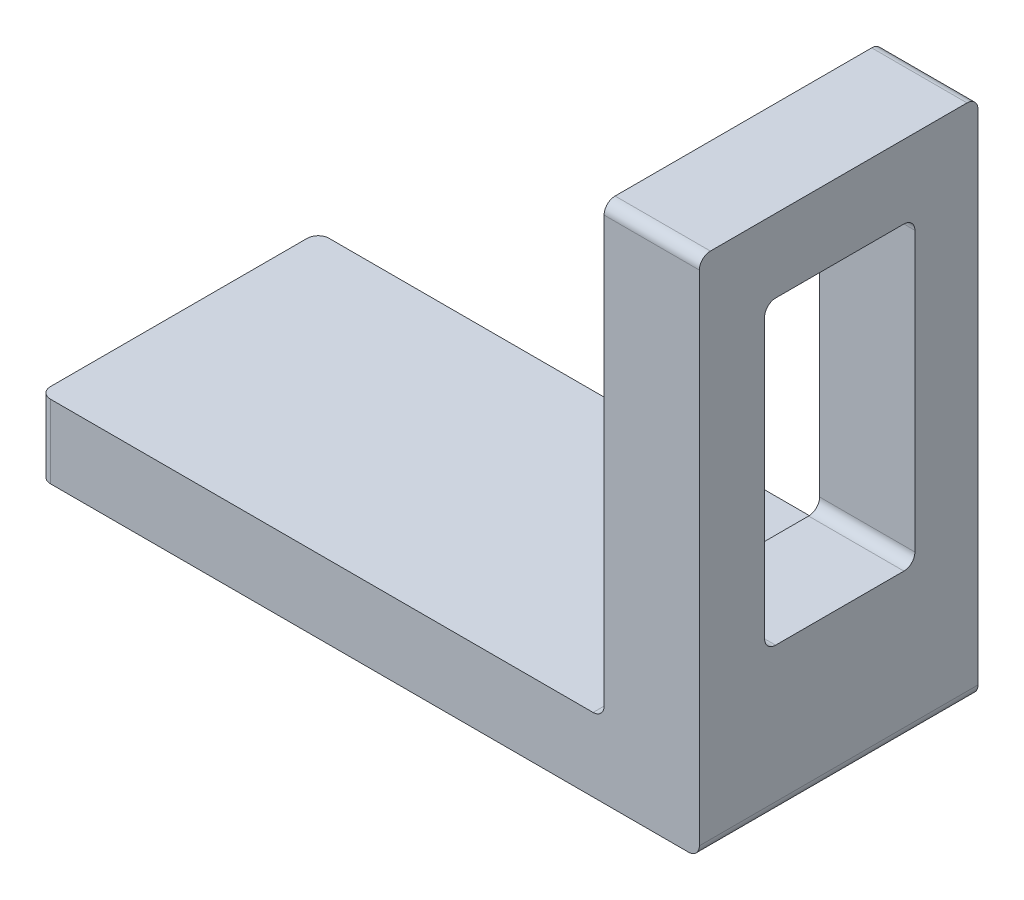
ISO-10303-21;
HEADER;
FILE_DESCRIPTION(('STEP AP214'),'2;1');
FILE_NAME('part.step','',(''),(''),'','','');
FILE_SCHEMA(('AUTOMOTIVE_DESIGN { 1 0 10303 214 1 1 1 1 }'));
ENDSEC;
DATA;
#1=APPLICATION_CONTEXT('core data for automotive mechanical design processes');
#2=APPLICATION_PROTOCOL_DEFINITION('international standard','automotive_design',2000,#1);
#3=PRODUCT_CONTEXT('',#1,'mechanical');
#4=PRODUCT('Part','Part','',(#3));
#5=PRODUCT_RELATED_PRODUCT_CATEGORY('part','',(#4));
#6=PRODUCT_DEFINITION_FORMATION('','',#4);
#7=PRODUCT_DEFINITION_CONTEXT('part definition',#1,'design');
#8=PRODUCT_DEFINITION('design','',#6,#7);
#9=PRODUCT_DEFINITION_SHAPE('','',#8);
#10=(LENGTH_UNIT() NAMED_UNIT(*) SI_UNIT(.MILLI.,.METRE.));
#11=(NAMED_UNIT(*) PLANE_ANGLE_UNIT() SI_UNIT($,.RADIAN.));
#12=(NAMED_UNIT(*) SI_UNIT($,.STERADIAN.) SOLID_ANGLE_UNIT());
#13=UNCERTAINTY_MEASURE_WITH_UNIT(LENGTH_MEASURE(1.E-05),#10,'distance_accuracy_value','');
#14=(GEOMETRIC_REPRESENTATION_CONTEXT(3) GLOBAL_UNCERTAINTY_ASSIGNED_CONTEXT((#13)) GLOBAL_UNIT_ASSIGNED_CONTEXT((#10,
#11,#12)) REPRESENTATION_CONTEXT('',''));
#15=CARTESIAN_POINT('',(0.,0.,0.));
#16=DIRECTION('',(0.,0.,1.));
#17=DIRECTION('',(1.,0.,0.));
#18=AXIS2_PLACEMENT_3D('',#15,#16,#17);
#19=CARTESIAN_POINT('',(0.,10.,38.));
#20=DIRECTION('',(1.,0.,0.));
#21=DIRECTION('',(0.,1.,0.));
#22=AXIS2_PLACEMENT_3D('',#19,#20,#21);
#23=PLANE('',#22);
#24=DIRECTION('',(0.,0.,-1.));
#25=VECTOR('',#24,1.);
#26=CARTESIAN_POINT('',(0.,10.,38.));
#27=LINE('',#26,#25);
#28=CARTESIAN_POINT('',(0.,10.,36.5));
#29=VERTEX_POINT('',#28);
#30=CARTESIAN_POINT('',(0.,10.,1.5));
#31=VERTEX_POINT('',#30);
#32=EDGE_CURVE('E361',#29,#31,#27,.T.);
#33=ORIENTED_EDGE('',*,*,#32,.T.);
#34=DIRECTION('',(0.,-1.,0.));
#35=VECTOR('',#34,1.);
#36=CARTESIAN_POINT('',(0.,10.,1.5));
#37=LINE('',#36,#35);
#38=CARTESIAN_POINT('',(0.,0.,1.5));
#39=VERTEX_POINT('',#38);
#40=EDGE_CURVE('E261',#31,#39,#37,.T.);
#41=ORIENTED_EDGE('',*,*,#40,.T.);
#42=DIRECTION('',(0.,0.,-1.));
#43=VECTOR('',#42,1.);
#44=CARTESIAN_POINT('',(0.,0.,38.));
#45=LINE('',#44,#43);
#46=CARTESIAN_POINT('',(0.,0.,36.5));
#47=VERTEX_POINT('',#46);
#48=EDGE_CURVE('E209',#47,#39,#45,.T.);
#49=ORIENTED_EDGE('',*,*,#48,.F.);
#50=DIRECTION('',(0.,-1.,0.));
#51=VECTOR('',#50,1.);
#52=CARTESIAN_POINT('',(0.,10.,36.5));
#53=LINE('',#52,#51);
#54=EDGE_CURVE('E258',#47,#29,#53,.F.);
#55=ORIENTED_EDGE('',*,*,#54,.T.);
#56=EDGE_LOOP('',(#33,#41,#49,#55));
#57=FACE_BOUND('',#56,.T.);
#58=ADVANCED_FACE('F39',(#57),#23,.F.);
#59=CARTESIAN_POINT('',(0.,0.,38.));
#60=DIRECTION('',(0.,1.,0.));
#61=DIRECTION('',(0.,0.,1.));
#62=AXIS2_PLACEMENT_3D('',#59,#60,#61);
#63=PLANE('',#62);
#64=CARTESIAN_POINT('',(23.6,0.,19.));
#65=DIRECTION('',(0.,-1.,0.));
#66=DIRECTION('',(0.,0.,-1.));
#67=AXIS2_PLACEMENT_3D('',#64,#65,#66);
#68=CIRCLE('',#67,1.4);
#69=CARTESIAN_POINT('',(23.6,0.,17.6));
#70=VERTEX_POINT('',#69);
#71=EDGE_CURVE('E441',#70,#70,#68,.T.);
#72=ORIENTED_EDGE('',*,*,#71,.F.);
#73=EDGE_LOOP('',(#72));
#74=FACE_BOUND('',#73,.T.);
#75=CARTESIAN_POINT('',(34.1,0.,8.5));
#76=DIRECTION('',(0.,-1.,0.));
#77=DIRECTION('',(0.,0.,-1.));
#78=AXIS2_PLACEMENT_3D('',#75,#76,#77);
#79=CIRCLE('',#78,1.4);
#80=CARTESIAN_POINT('',(34.1,0.,7.1));
#81=VERTEX_POINT('',#80);
#82=EDGE_CURVE('E437',#81,#81,#79,.T.);
#83=ORIENTED_EDGE('',*,*,#82,.F.);
#84=EDGE_LOOP('',(#83));
#85=FACE_BOUND('',#84,.T.);
#86=CARTESIAN_POINT('',(44.6,0.,19.));
#87=DIRECTION('',(0.,-1.,0.));
#88=DIRECTION('',(0.,0.,-1.));
#89=AXIS2_PLACEMENT_3D('',#86,#87,#88);
#90=CIRCLE('',#89,1.4);
#91=CARTESIAN_POINT('',(44.6,0.,17.6));
#92=VERTEX_POINT('',#91);
#93=EDGE_CURVE('E429',#92,#92,#90,.T.);
#94=ORIENTED_EDGE('',*,*,#93,.F.);
#95=EDGE_LOOP('',(#94));
#96=FACE_BOUND('',#95,.T.);
#97=CARTESIAN_POINT('',(34.1,0.,29.5));
#98=DIRECTION('',(0.,-1.,0.));
#99=DIRECTION('',(0.,0.,-1.));
#100=AXIS2_PLACEMENT_3D('',#97,#98,#99);
#101=CIRCLE('',#100,1.4);
#102=CARTESIAN_POINT('',(34.1,0.,28.1));
#103=VERTEX_POINT('',#102);
#104=EDGE_CURVE('E420',#103,#103,#101,.T.);
#105=ORIENTED_EDGE('',*,*,#104,.F.);
#106=EDGE_LOOP('',(#105));
#107=FACE_BOUND('',#106,.T.);
#108=ORIENTED_EDGE('',*,*,#48,.T.);
#109=CARTESIAN_POINT('',(1.5,0.,1.5));
#110=DIRECTION('',(0.,1.,0.));
#111=DIRECTION('',(0.,0.,1.));
#112=AXIS2_PLACEMENT_3D('',#109,#110,#111);
#113=CIRCLE('',#112,1.5);
#114=CARTESIAN_POINT('',(1.5,0.,0.));
#115=VERTEX_POINT('',#114);
#116=EDGE_CURVE('E271',#39,#115,#113,.F.);
#117=ORIENTED_EDGE('',*,*,#116,.T.);
#118=DIRECTION('',(1.,0.,0.));
#119=VECTOR('',#118,1.);
#120=CARTESIAN_POINT('',(0.,0.,0.));
#121=LINE('',#120,#119);
#122=CARTESIAN_POINT('',(88.5,0.,0.));
#123=VERTEX_POINT('',#122);
#124=EDGE_CURVE('E372',#115,#123,#121,.T.);
#125=ORIENTED_EDGE('',*,*,#124,.T.);
#126=DIRECTION('',(0.,0.,-1.));
#127=VECTOR('',#126,1.);
#128=CARTESIAN_POINT('',(88.5,0.,38.));
#129=LINE('',#128,#127);
#130=CARTESIAN_POINT('',(88.5,0.,38.));
#131=VERTEX_POINT('',#130);
#132=EDGE_CURVE('E265',#123,#131,#129,.F.);
#133=ORIENTED_EDGE('',*,*,#132,.T.);
#134=DIRECTION('',(1.,0.,0.));
#135=VECTOR('',#134,1.);
#136=CARTESIAN_POINT('',(0.,0.,38.));
#137=LINE('',#136,#135);
#138=CARTESIAN_POINT('',(1.5,0.,38.));
#139=VERTEX_POINT('',#138);
#140=EDGE_CURVE('E380',#139,#131,#137,.T.);
#141=ORIENTED_EDGE('',*,*,#140,.F.);
#142=CARTESIAN_POINT('',(1.5,0.,36.5));
#143=DIRECTION('',(0.,1.,0.));
#144=DIRECTION('',(0.,0.,1.));
#145=AXIS2_PLACEMENT_3D('',#142,#143,#144);
#146=CIRCLE('',#145,1.5);
#147=EDGE_CURVE('E268',#139,#47,#146,.F.);
#148=ORIENTED_EDGE('',*,*,#147,.T.);
#149=EDGE_LOOP('',(#108,#117,#125,#133,#141,#148));
#150=FACE_BOUND('',#149,.T.);
#151=ADVANCED_FACE('F400',(#74,#85,#96,#107,#150),#63,.F.);
#152=CARTESIAN_POINT('',(90.,0.,38.));
#153=DIRECTION('',(-1.,0.,0.));
#154=DIRECTION('',(0.,0.,1.));
#155=AXIS2_PLACEMENT_3D('',#152,#153,#154);
#156=PLANE('',#155);
#157=DIRECTION('',(0.,0.,1.));
#158=VECTOR('',#157,1.);
#159=CARTESIAN_POINT('',(90.,61.,8.60479197064023));
#160=LINE('',#159,#158);
#161=CARTESIAN_POINT('',(90.,61.,10.1047919706402));
#162=VERTEX_POINT('',#161);
#163=CARTESIAN_POINT('',(90.,61.,27.6047919706402));
#164=VERTEX_POINT('',#163);
#165=EDGE_CURVE('E421',#162,#164,#160,.T.);
#166=ORIENTED_EDGE('',*,*,#165,.F.);
#167=CARTESIAN_POINT('',(90.,59.5,10.1047919706402));
#168=DIRECTION('',(-1.,0.,0.));
#169=DIRECTION('',(0.,0.,1.));
#170=AXIS2_PLACEMENT_3D('',#167,#168,#169);
#171=CIRCLE('',#170,1.5);
#172=CARTESIAN_POINT('',(90.,59.5,8.60479197064023));
#173=VERTEX_POINT('',#172);
#174=EDGE_CURVE('E191',#162,#173,#171,.T.);
#175=ORIENTED_EDGE('',*,*,#174,.T.);
#176=DIRECTION('',(0.,-1.,0.));
#177=VECTOR('',#176,1.);
#178=CARTESIAN_POINT('',(90.,61.,8.60479197064023));
#179=LINE('',#178,#177);
#180=CARTESIAN_POINT('',(90.,21.5,8.60479197064024));
#181=VERTEX_POINT('',#180);
#182=EDGE_CURVE('E203',#173,#181,#179,.T.);
#183=ORIENTED_EDGE('',*,*,#182,.T.);
#184=CARTESIAN_POINT('',(90.,21.5,10.1047919706402));
#185=DIRECTION('',(-1.,0.,0.));
#186=DIRECTION('',(0.,0.,1.));
#187=AXIS2_PLACEMENT_3D('',#184,#185,#186);
#188=CIRCLE('',#187,1.5);
#189=CARTESIAN_POINT('',(90.,20.,10.1047919706402));
#190=VERTEX_POINT('',#189);
#191=EDGE_CURVE('E255',#181,#190,#188,.T.);
#192=ORIENTED_EDGE('',*,*,#191,.T.);
#193=DIRECTION('',(0.,0.,1.));
#194=VECTOR('',#193,1.);
#195=CARTESIAN_POINT('',(90.,20.,8.60479197064024));
#196=LINE('',#195,#194);
#197=CARTESIAN_POINT('',(90.,20.,27.6047919706402));
#198=VERTEX_POINT('',#197);
#199=EDGE_CURVE('E464',#190,#198,#196,.T.);
#200=ORIENTED_EDGE('',*,*,#199,.T.);
#201=CARTESIAN_POINT('',(90.,21.5,27.6047919706402));
#202=DIRECTION('',(-1.,0.,0.));
#203=DIRECTION('',(0.,0.,1.));
#204=AXIS2_PLACEMENT_3D('',#201,#202,#203);
#205=CIRCLE('',#204,1.5);
#206=CARTESIAN_POINT('',(90.,21.5,29.1047919706402));
#207=VERTEX_POINT('',#206);
#208=EDGE_CURVE('E249',#198,#207,#205,.T.);
#209=ORIENTED_EDGE('',*,*,#208,.T.);
#210=DIRECTION('',(0.,-1.,0.));
#211=VECTOR('',#210,1.);
#212=CARTESIAN_POINT('',(90.,61.,29.1047919706402));
#213=LINE('',#212,#211);
#214=CARTESIAN_POINT('',(90.,59.5,29.1047919706402));
#215=VERTEX_POINT('',#214);
#216=EDGE_CURVE('E460',#215,#207,#213,.T.);
#217=ORIENTED_EDGE('',*,*,#216,.F.);
#218=CARTESIAN_POINT('',(90.,59.5,27.6047919706402));
#219=DIRECTION('',(-1.,0.,0.));
#220=DIRECTION('',(0.,0.,1.));
#221=AXIS2_PLACEMENT_3D('',#218,#219,#220);
#222=CIRCLE('',#221,1.5);
#223=EDGE_CURVE('E192',#215,#164,#222,.T.);
#224=ORIENTED_EDGE('',*,*,#223,.T.);
#225=EDGE_LOOP('',(#166,#175,#183,#192,#200,#209,#217,#224));
#226=FACE_BOUND('',#225,.T.);
#227=DIRECTION('',(0.,1.,0.));
#228=VECTOR('',#227,1.);
#229=CARTESIAN_POINT('',(90.,0.,38.));
#230=LINE('',#229,#228);
#231=CARTESIAN_POINT('',(90.,1.5,38.));
#232=VERTEX_POINT('',#231);
#233=CARTESIAN_POINT('',(90.,69.5,38.));
#234=VERTEX_POINT('',#233);
#235=EDGE_CURVE('E368',#232,#234,#230,.T.);
#236=ORIENTED_EDGE('',*,*,#235,.F.);
#237=DIRECTION('',(0.,0.,-1.));
#238=VECTOR('',#237,1.);
#239=CARTESIAN_POINT('',(90.,1.5,38.));
#240=LINE('',#239,#238);
#241=CARTESIAN_POINT('',(90.,1.5,0.));
#242=VERTEX_POINT('',#241);
#243=EDGE_CURVE('E318',#232,#242,#240,.T.);
#244=ORIENTED_EDGE('',*,*,#243,.T.);
#245=DIRECTION('',(0.,1.,0.));
#246=VECTOR('',#245,1.);
#247=CARTESIAN_POINT('',(90.,0.,0.));
#248=LINE('',#247,#246);
#249=CARTESIAN_POINT('',(90.,69.5,0.));
#250=VERTEX_POINT('',#249);
#251=EDGE_CURVE('E345',#242,#250,#248,.T.);
#252=ORIENTED_EDGE('',*,*,#251,.T.);
#253=CARTESIAN_POINT('',(90.,69.5,1.5));
#254=DIRECTION('',(-1.,0.,0.));
#255=DIRECTION('',(0.,0.,1.));
#256=AXIS2_PLACEMENT_3D('',#253,#254,#255);
#257=CIRCLE('',#256,1.5);
#258=CARTESIAN_POINT('',(90.,71.,1.5));
#259=VERTEX_POINT('',#258);
#260=EDGE_CURVE('E55',#250,#259,#257,.F.);
#261=ORIENTED_EDGE('',*,*,#260,.T.);
#262=DIRECTION('',(0.,0.,-1.));
#263=VECTOR('',#262,1.);
#264=CARTESIAN_POINT('',(90.,71.,38.));
#265=LINE('',#264,#263);
#266=CARTESIAN_POINT('',(90.,71.,36.5));
#267=VERTEX_POINT('',#266);
#268=EDGE_CURVE('E216',#267,#259,#265,.T.);
#269=ORIENTED_EDGE('',*,*,#268,.F.);
#270=CARTESIAN_POINT('',(90.,69.5,36.5));
#271=DIRECTION('',(-1.,0.,0.));
#272=DIRECTION('',(0.,0.,1.));
#273=AXIS2_PLACEMENT_3D('',#270,#271,#272);
#274=CIRCLE('',#273,1.5);
#275=EDGE_CURVE('E313',#267,#234,#274,.F.);
#276=ORIENTED_EDGE('',*,*,#275,.T.);
#277=EDGE_LOOP('',(#236,#244,#252,#261,#269,#276));
#278=FACE_BOUND('',#277,.T.);
#279=ADVANCED_FACE('F391',(#226,#278),#156,.F.);
#280=CARTESIAN_POINT('',(90.,71.,38.));
#281=DIRECTION('',(0.,-1.,0.));
#282=DIRECTION('',(0.,0.,-1.));
#283=AXIS2_PLACEMENT_3D('',#280,#281,#282);
#284=PLANE('',#283);
#285=ORIENTED_EDGE('',*,*,#268,.T.);
#286=DIRECTION('',(-1.,0.,0.));
#287=VECTOR('',#286,1.);
#288=CARTESIAN_POINT('',(90.,71.,1.5));
#289=LINE('',#288,#287);
#290=CARTESIAN_POINT('',(77.,71.,1.5));
#291=VERTEX_POINT('',#290);
#292=EDGE_CURVE('E324',#259,#291,#289,.T.);
#293=ORIENTED_EDGE('',*,*,#292,.T.);
#294=DIRECTION('',(0.,0.,-1.));
#295=VECTOR('',#294,1.);
#296=CARTESIAN_POINT('',(77.,71.,38.));
#297=LINE('',#296,#295);
#298=CARTESIAN_POINT('',(77.,71.,36.5));
#299=VERTEX_POINT('',#298);
#300=EDGE_CURVE('E366',#299,#291,#297,.T.);
#301=ORIENTED_EDGE('',*,*,#300,.F.);
#302=DIRECTION('',(-1.,0.,0.));
#303=VECTOR('',#302,1.);
#304=CARTESIAN_POINT('',(90.,71.,36.5));
#305=LINE('',#304,#303);
#306=EDGE_CURVE('E62',#299,#267,#305,.F.);
#307=ORIENTED_EDGE('',*,*,#306,.T.);
#308=EDGE_LOOP('',(#285,#293,#301,#307));
#309=FACE_BOUND('',#308,.T.);
#310=ADVANCED_FACE('F385',(#309),#284,.F.);
#311=CARTESIAN_POINT('',(77.,71.,38.));
#312=DIRECTION('',(1.,0.,0.));
#313=DIRECTION('',(0.,1.,0.));
#314=AXIS2_PLACEMENT_3D('',#311,#312,#313);
#315=PLANE('',#314);
#316=CARTESIAN_POINT('',(77.,65.0160243523246,23.8065505765066));
#317=DIRECTION('',(-1.,0.,0.));
#318=DIRECTION('',(0.,-1.,0.));
#319=AXIS2_PLACEMENT_3D('',#316,#317,#318);
#320=CIRCLE('',#319,1.4);
#321=CARTESIAN_POINT('',(77.,63.6160243523247,23.8065505765066));
#322=VERTEX_POINT('',#321);
#323=EDGE_CURVE('E488',#322,#322,#320,.T.);
#324=ORIENTED_EDGE('',*,*,#323,.F.);
#325=EDGE_LOOP('',(#324));
#326=FACE_BOUND('',#325,.T.);
#327=CARTESIAN_POINT('',(77.,16.4160243523246,13.9065505765066));
#328=DIRECTION('',(-1.,0.,0.));
#329=DIRECTION('',(0.,-1.,0.));
#330=AXIS2_PLACEMENT_3D('',#327,#328,#329);
#331=CIRCLE('',#330,1.4);
#332=CARTESIAN_POINT('',(77.,15.0160243523246,13.9065505765066));
#333=VERTEX_POINT('',#332);
#334=EDGE_CURVE('E479',#333,#333,#331,.T.);
#335=ORIENTED_EDGE('',*,*,#334,.F.);
#336=EDGE_LOOP('',(#335));
#337=FACE_BOUND('',#336,.T.);
#338=CARTESIAN_POINT('',(77.,16.4160243523246,23.8065505765066));
#339=DIRECTION('',(-1.,0.,0.));
#340=DIRECTION('',(0.,-1.,0.));
#341=AXIS2_PLACEMENT_3D('',#338,#339,#340);
#342=CIRCLE('',#341,1.4);
#343=CARTESIAN_POINT('',(77.,15.0160243523246,23.8065505765066));
#344=VERTEX_POINT('',#343);
#345=EDGE_CURVE('E495',#344,#344,#342,.T.);
#346=ORIENTED_EDGE('',*,*,#345,.F.);
#347=EDGE_LOOP('',(#346));
#348=FACE_BOUND('',#347,.T.);
#349=CARTESIAN_POINT('',(77.,65.0160243523246,13.9065505765066));
#350=DIRECTION('',(-1.,0.,0.));
#351=DIRECTION('',(0.,-1.,0.));
#352=AXIS2_PLACEMENT_3D('',#349,#350,#351);
#353=CIRCLE('',#352,1.4);
#354=CARTESIAN_POINT('',(77.,63.6160243523247,13.9065505765066));
#355=VERTEX_POINT('',#354);
#356=EDGE_CURVE('E471',#355,#355,#353,.T.);
#357=ORIENTED_EDGE('',*,*,#356,.F.);
#358=EDGE_LOOP('',(#357));
#359=FACE_BOUND('',#358,.T.);
#360=DIRECTION('',(0.,0.,1.));
#361=VECTOR('',#360,1.);
#362=CARTESIAN_POINT('',(77.,20.,8.60479197064024));
#363=LINE('',#362,#361);
#364=CARTESIAN_POINT('',(77.,20.,10.1047919706402));
#365=VERTEX_POINT('',#364);
#366=CARTESIAN_POINT('',(77.,20.,27.6047919706402));
#367=VERTEX_POINT('',#366);
#368=EDGE_CURVE('E451',#365,#367,#363,.T.);
#369=ORIENTED_EDGE('',*,*,#368,.F.);
#370=CARTESIAN_POINT('',(77.,21.5,10.1047919706402));
#371=DIRECTION('',(1.,0.,0.));
#372=DIRECTION('',(0.,1.,0.));
#373=AXIS2_PLACEMENT_3D('',#370,#371,#372);
#374=CIRCLE('',#373,1.5);
#375=CARTESIAN_POINT('',(77.,21.5,8.60479197064024));
#376=VERTEX_POINT('',#375);
#377=EDGE_CURVE('E252',#365,#376,#374,.T.);
#378=ORIENTED_EDGE('',*,*,#377,.T.);
#379=DIRECTION('',(0.,-1.,0.));
#380=VECTOR('',#379,1.);
#381=CARTESIAN_POINT('',(77.,61.,8.60479197064023));
#382=LINE('',#381,#380);
#383=CARTESIAN_POINT('',(77.,59.5,8.60479197064023));
#384=VERTEX_POINT('',#383);
#385=EDGE_CURVE('E185',#384,#376,#382,.T.);
#386=ORIENTED_EDGE('',*,*,#385,.F.);
#387=CARTESIAN_POINT('',(77.,59.5,10.1047919706402));
#388=DIRECTION('',(1.,0.,0.));
#389=DIRECTION('',(0.,1.,0.));
#390=AXIS2_PLACEMENT_3D('',#387,#388,#389);
#391=CIRCLE('',#390,1.5);
#392=CARTESIAN_POINT('',(77.,61.,10.1047919706402));
#393=VERTEX_POINT('',#392);
#394=EDGE_CURVE('E178',#384,#393,#391,.T.);
#395=ORIENTED_EDGE('',*,*,#394,.T.);
#396=DIRECTION('',(0.,0.,1.));
#397=VECTOR('',#396,1.);
#398=CARTESIAN_POINT('',(77.,61.,8.60479197064023));
#399=LINE('',#398,#397);
#400=CARTESIAN_POINT('',(77.,61.,27.6047919706402));
#401=VERTEX_POINT('',#400);
#402=EDGE_CURVE('E183',#393,#401,#399,.T.);
#403=ORIENTED_EDGE('',*,*,#402,.T.);
#404=CARTESIAN_POINT('',(77.,59.5,27.6047919706402));
#405=DIRECTION('',(1.,0.,0.));
#406=DIRECTION('',(0.,1.,0.));
#407=AXIS2_PLACEMENT_3D('',#404,#405,#406);
#408=CIRCLE('',#407,1.5);
#409=CARTESIAN_POINT('',(77.,59.5,29.1047919706402));
#410=VERTEX_POINT('',#409);
#411=EDGE_CURVE('E239',#401,#410,#408,.T.);
#412=ORIENTED_EDGE('',*,*,#411,.T.);
#413=DIRECTION('',(0.,-1.,0.));
#414=VECTOR('',#413,1.);
#415=CARTESIAN_POINT('',(77.,61.,29.1047919706402));
#416=LINE('',#415,#414);
#417=CARTESIAN_POINT('',(77.,21.5,29.1047919706402));
#418=VERTEX_POINT('',#417);
#419=EDGE_CURVE('E204',#410,#418,#416,.T.);
#420=ORIENTED_EDGE('',*,*,#419,.T.);
#421=CARTESIAN_POINT('',(77.,21.5,27.6047919706402));
#422=DIRECTION('',(1.,0.,0.));
#423=DIRECTION('',(0.,1.,0.));
#424=AXIS2_PLACEMENT_3D('',#421,#422,#423);
#425=CIRCLE('',#424,1.5);
#426=EDGE_CURVE('E246',#418,#367,#425,.T.);
#427=ORIENTED_EDGE('',*,*,#426,.T.);
#428=EDGE_LOOP('',(#369,#378,#386,#395,#403,#412,#420,#427));
#429=FACE_BOUND('',#428,.T.);
#430=DIRECTION('',(0.,-1.,0.));
#431=VECTOR('',#430,1.);
#432=CARTESIAN_POINT('',(77.,71.,0.));
#433=LINE('',#432,#431);
#434=CARTESIAN_POINT('',(77.,69.5,0.));
#435=VERTEX_POINT('',#434);
#436=CARTESIAN_POINT('',(77.,11.5,0.));
#437=VERTEX_POINT('',#436);
#438=EDGE_CURVE('E334',#435,#437,#433,.T.);
#439=ORIENTED_EDGE('',*,*,#438,.T.);
#440=DIRECTION('',(0.,0.,-1.));
#441=VECTOR('',#440,1.);
#442=CARTESIAN_POINT('',(77.,11.5,38.));
#443=LINE('',#442,#441);
#444=CARTESIAN_POINT('',(77.,11.5,38.));
#445=VERTEX_POINT('',#444);
#446=EDGE_CURVE('E310',#437,#445,#443,.F.);
#447=ORIENTED_EDGE('',*,*,#446,.T.);
#448=DIRECTION('',(0.,-1.,0.));
#449=VECTOR('',#448,1.);
#450=CARTESIAN_POINT('',(77.,71.,38.));
#451=LINE('',#450,#449);
#452=CARTESIAN_POINT('',(77.,69.5,38.));
#453=VERTEX_POINT('',#452);
#454=EDGE_CURVE('E355',#453,#445,#451,.T.);
#455=ORIENTED_EDGE('',*,*,#454,.F.);
#456=CARTESIAN_POINT('',(77.,69.5,36.5));
#457=DIRECTION('',(1.,0.,0.));
#458=DIRECTION('',(0.,1.,0.));
#459=AXIS2_PLACEMENT_3D('',#456,#457,#458);
#460=CIRCLE('',#459,1.5);
#461=EDGE_CURVE('E304',#453,#299,#460,.F.);
#462=ORIENTED_EDGE('',*,*,#461,.T.);
#463=ORIENTED_EDGE('',*,*,#300,.T.);
#464=CARTESIAN_POINT('',(77.,69.5,1.5));
#465=DIRECTION('',(1.,0.,0.));
#466=DIRECTION('',(0.,1.,0.));
#467=AXIS2_PLACEMENT_3D('',#464,#465,#466);
#468=CIRCLE('',#467,1.5);
#469=EDGE_CURVE('E307',#291,#435,#468,.F.);
#470=ORIENTED_EDGE('',*,*,#469,.T.);
#471=EDGE_LOOP('',(#439,#447,#455,#462,#463,#470));
#472=FACE_BOUND('',#471,.T.);
#473=ADVANCED_FACE('F181',(#326,#337,#348,#359,#429,#472),#315,.F.);
#474=CARTESIAN_POINT('',(77.,10.,38.));
#475=DIRECTION('',(0.,-1.,0.));
#476=DIRECTION('',(1.,0.,0.));
#477=AXIS2_PLACEMENT_3D('',#474,#475,#476);
#478=PLANE('',#477);
#479=DIRECTION('',(-1.,0.,0.));
#480=VECTOR('',#479,1.);
#481=CARTESIAN_POINT('',(77.,10.,0.));
#482=LINE('',#481,#480);
#483=CARTESIAN_POINT('',(75.5,10.,0.));
#484=VERTEX_POINT('',#483);
#485=CARTESIAN_POINT('',(1.5,10.,0.));
#486=VERTEX_POINT('',#485);
#487=EDGE_CURVE('E337',#484,#486,#482,.T.);
#488=ORIENTED_EDGE('',*,*,#487,.T.);
#489=CARTESIAN_POINT('',(1.5,10.,1.5));
#490=DIRECTION('',(0.,-1.,0.));
#491=DIRECTION('',(1.,0.,0.));
#492=AXIS2_PLACEMENT_3D('',#489,#490,#491);
#493=CIRCLE('',#492,1.5);
#494=EDGE_CURVE('E290',#486,#31,#493,.F.);
#495=ORIENTED_EDGE('',*,*,#494,.T.);
#496=ORIENTED_EDGE('',*,*,#32,.F.);
#497=CARTESIAN_POINT('',(1.5,10.,36.5));
#498=DIRECTION('',(0.,-1.,0.));
#499=DIRECTION('',(1.,0.,0.));
#500=AXIS2_PLACEMENT_3D('',#497,#498,#499);
#501=CIRCLE('',#500,1.5);
#502=CARTESIAN_POINT('',(1.5,10.,38.));
#503=VERTEX_POINT('',#502);
#504=EDGE_CURVE('E287',#29,#503,#501,.F.);
#505=ORIENTED_EDGE('',*,*,#504,.T.);
#506=DIRECTION('',(-1.,0.,0.));
#507=VECTOR('',#506,1.);
#508=CARTESIAN_POINT('',(77.,10.,38.));
#509=LINE('',#508,#507);
#510=CARTESIAN_POINT('',(75.5,10.,38.));
#511=VERTEX_POINT('',#510);
#512=EDGE_CURVE('E353',#511,#503,#509,.T.);
#513=ORIENTED_EDGE('',*,*,#512,.F.);
#514=DIRECTION('',(0.,0.,-1.));
#515=VECTOR('',#514,1.);
#516=CARTESIAN_POINT('',(75.5,10.,0.));
#517=LINE('',#516,#515);
#518=EDGE_CURVE('E283',#511,#484,#517,.T.);
#519=ORIENTED_EDGE('',*,*,#518,.T.);
#520=EDGE_LOOP('',(#488,#495,#496,#505,#513,#519));
#521=FACE_BOUND('',#520,.T.);
#522=ADVANCED_FACE('F357',(#521),#478,.F.);
#523=CARTESIAN_POINT('',(0.,0.,38.));
#524=DIRECTION('',(0.,0.,1.));
#525=DIRECTION('',(1.,0.,0.));
#526=AXIS2_PLACEMENT_3D('',#523,#524,#525);
#527=PLANE('',#526);
#528=ORIENTED_EDGE('',*,*,#512,.T.);
#529=DIRECTION('',(0.,-1.,0.));
#530=VECTOR('',#529,1.);
#531=CARTESIAN_POINT('',(1.5,0.,38.));
#532=LINE('',#531,#530);
#533=EDGE_CURVE('E300',#503,#139,#532,.T.);
#534=ORIENTED_EDGE('',*,*,#533,.T.);
#535=ORIENTED_EDGE('',*,*,#140,.T.);
#536=CARTESIAN_POINT('',(88.5,1.5,38.));
#537=DIRECTION('',(0.,0.,1.));
#538=DIRECTION('',(1.,0.,0.));
#539=AXIS2_PLACEMENT_3D('',#536,#537,#538);
#540=CIRCLE('',#539,1.5);
#541=EDGE_CURVE('E297',#131,#232,#540,.T.);
#542=ORIENTED_EDGE('',*,*,#541,.T.);
#543=ORIENTED_EDGE('',*,*,#235,.T.);
#544=DIRECTION('',(-1.,0.,0.));
#545=VECTOR('',#544,1.);
#546=CARTESIAN_POINT('',(77.,69.5,38.));
#547=LINE('',#546,#545);
#548=EDGE_CURVE('E293',#234,#453,#547,.T.);
#549=ORIENTED_EDGE('',*,*,#548,.T.);
#550=ORIENTED_EDGE('',*,*,#454,.T.);
#551=CARTESIAN_POINT('',(75.5,11.5,38.));
#552=DIRECTION('',(0.,0.,1.));
#553=DIRECTION('',(1.,0.,0.));
#554=AXIS2_PLACEMENT_3D('',#551,#552,#553);
#555=CIRCLE('',#554,1.5);
#556=EDGE_CURVE('E11',#445,#511,#555,.F.);
#557=ORIENTED_EDGE('',*,*,#556,.T.);
#558=EDGE_LOOP('',(#528,#534,#535,#542,#543,#549,#550,#557));
#559=FACE_BOUND('',#558,.T.);
#560=ADVANCED_FACE('F352',(#559),#527,.T.);
#561=CARTESIAN_POINT('',(0.,0.,0.));
#562=DIRECTION('',(0.,0.,1.));
#563=DIRECTION('',(1.,0.,0.));
#564=AXIS2_PLACEMENT_3D('',#561,#562,#563);
#565=PLANE('',#564);
#566=ORIENTED_EDGE('',*,*,#124,.F.);
#567=DIRECTION('',(0.,-1.,0.));
#568=VECTOR('',#567,1.);
#569=CARTESIAN_POINT('',(1.5,0.,0.));
#570=LINE('',#569,#568);
#571=EDGE_CURVE('E280',#115,#486,#570,.F.);
#572=ORIENTED_EDGE('',*,*,#571,.T.);
#573=ORIENTED_EDGE('',*,*,#487,.F.);
#574=CARTESIAN_POINT('',(75.5,11.5,0.));
#575=DIRECTION('',(0.,0.,1.));
#576=DIRECTION('',(1.,0.,0.));
#577=AXIS2_PLACEMENT_3D('',#574,#575,#576);
#578=CIRCLE('',#577,1.5);
#579=EDGE_CURVE('E48',#484,#437,#578,.T.);
#580=ORIENTED_EDGE('',*,*,#579,.T.);
#581=ORIENTED_EDGE('',*,*,#438,.F.);
#582=DIRECTION('',(-1.,0.,0.));
#583=VECTOR('',#582,1.);
#584=CARTESIAN_POINT('',(0.,69.5,0.));
#585=LINE('',#584,#583);
#586=EDGE_CURVE('E274',#435,#250,#585,.F.);
#587=ORIENTED_EDGE('',*,*,#586,.T.);
#588=ORIENTED_EDGE('',*,*,#251,.F.);
#589=CARTESIAN_POINT('',(88.5,1.5,0.));
#590=DIRECTION('',(0.,0.,1.));
#591=DIRECTION('',(1.,0.,0.));
#592=AXIS2_PLACEMENT_3D('',#589,#590,#591);
#593=CIRCLE('',#592,1.5);
#594=EDGE_CURVE('E277',#242,#123,#593,.F.);
#595=ORIENTED_EDGE('',*,*,#594,.T.);
#596=EDGE_LOOP('',(#566,#572,#573,#580,#581,#587,#588,#595));
#597=FACE_BOUND('',#596,.T.);
#598=ADVANCED_FACE('F333',(#597),#565,.F.);
#599=CARTESIAN_POINT('',(34.1,8.,29.5));
#600=DIRECTION('',(0.,-1.,0.));
#601=DIRECTION('',(0.,0.,-1.));
#602=AXIS2_PLACEMENT_3D('',#599,#600,#601);
#603=CYLINDRICAL_SURFACE('',#602,1.4);
#604=CARTESIAN_POINT('',(34.1,8.,29.5));
#605=DIRECTION('',(0.,-1.,0.));
#606=DIRECTION('',(0.,0.,-1.));
#607=AXIS2_PLACEMENT_3D('',#604,#605,#606);
#608=CIRCLE('',#607,1.4);
#609=CARTESIAN_POINT('',(34.1,8.,28.1));
#610=VERTEX_POINT('',#609);
#611=EDGE_CURVE('E416',#610,#610,#608,.T.);
#612=ORIENTED_EDGE('',*,*,#611,.F.);
#613=EDGE_LOOP('',(#612));
#614=FACE_BOUND('',#613,.T.);
#615=ORIENTED_EDGE('',*,*,#104,.T.);
#616=EDGE_LOOP('',(#615));
#617=FACE_BOUND('',#616,.T.);
#618=ADVANCED_FACE('F611',(#614,#617),#603,.F.);
#619=CARTESIAN_POINT('',(34.1,8.,29.5));
#620=DIRECTION('',(0.,-1.,0.));
#621=DIRECTION('',(0.,0.,-1.));
#622=AXIS2_PLACEMENT_3D('',#619,#620,#621);
#623=PLANE('',#622);
#624=ORIENTED_EDGE('',*,*,#611,.T.);
#625=EDGE_LOOP('',(#624));
#626=FACE_BOUND('',#625,.T.);
#627=ADVANCED_FACE('F839',(#626),#623,.T.);
#628=CARTESIAN_POINT('',(44.6,8.,19.));
#629=DIRECTION('',(0.,-1.,0.));
#630=DIRECTION('',(0.,0.,-1.));
#631=AXIS2_PLACEMENT_3D('',#628,#629,#630);
#632=CYLINDRICAL_SURFACE('',#631,1.4);
#633=CARTESIAN_POINT('',(44.6,8.,19.));
#634=DIRECTION('',(0.,-1.,0.));
#635=DIRECTION('',(0.,0.,-1.));
#636=AXIS2_PLACEMENT_3D('',#633,#634,#635);
#637=CIRCLE('',#636,1.4);
#638=CARTESIAN_POINT('',(44.6,8.,17.6));
#639=VERTEX_POINT('',#638);
#640=EDGE_CURVE('E425',#639,#639,#637,.T.);
#641=ORIENTED_EDGE('',*,*,#640,.F.);
#642=EDGE_LOOP('',(#641));
#643=FACE_BOUND('',#642,.T.);
#644=ORIENTED_EDGE('',*,*,#93,.T.);
#645=EDGE_LOOP('',(#644));
#646=FACE_BOUND('',#645,.T.);
#647=ADVANCED_FACE('F829',(#643,#646),#632,.F.);
#648=CARTESIAN_POINT('',(44.6,8.,19.));
#649=DIRECTION('',(0.,-1.,0.));
#650=DIRECTION('',(0.,0.,-1.));
#651=AXIS2_PLACEMENT_3D('',#648,#649,#650);
#652=PLANE('',#651);
#653=ORIENTED_EDGE('',*,*,#640,.T.);
#654=EDGE_LOOP('',(#653));
#655=FACE_BOUND('',#654,.T.);
#656=ADVANCED_FACE('F819',(#655),#652,.T.);
#657=CARTESIAN_POINT('',(34.1,8.,8.5));
#658=DIRECTION('',(0.,-1.,0.));
#659=DIRECTION('',(0.,0.,-1.));
#660=AXIS2_PLACEMENT_3D('',#657,#658,#659);
#661=CYLINDRICAL_SURFACE('',#660,1.4);
#662=CARTESIAN_POINT('',(34.1,8.,8.5));
#663=DIRECTION('',(0.,-1.,0.));
#664=DIRECTION('',(0.,0.,-1.));
#665=AXIS2_PLACEMENT_3D('',#662,#663,#664);
#666=CIRCLE('',#665,1.4);
#667=CARTESIAN_POINT('',(34.1,8.,7.1));
#668=VERTEX_POINT('',#667);
#669=EDGE_CURVE('E433',#668,#668,#666,.T.);
#670=ORIENTED_EDGE('',*,*,#669,.F.);
#671=EDGE_LOOP('',(#670));
#672=FACE_BOUND('',#671,.T.);
#673=ORIENTED_EDGE('',*,*,#82,.T.);
#674=EDGE_LOOP('',(#673));
#675=FACE_BOUND('',#674,.T.);
#676=ADVANCED_FACE('F809',(#672,#675),#661,.F.);
#677=CARTESIAN_POINT('',(34.1,8.,8.5));
#678=DIRECTION('',(0.,-1.,0.));
#679=DIRECTION('',(0.,0.,-1.));
#680=AXIS2_PLACEMENT_3D('',#677,#678,#679);
#681=PLANE('',#680);
#682=ORIENTED_EDGE('',*,*,#669,.T.);
#683=EDGE_LOOP('',(#682));
#684=FACE_BOUND('',#683,.T.);
#685=ADVANCED_FACE('F799',(#684),#681,.T.);
#686=CARTESIAN_POINT('',(23.6,8.,19.));
#687=DIRECTION('',(0.,-1.,0.));
#688=DIRECTION('',(0.,0.,-1.));
#689=AXIS2_PLACEMENT_3D('',#686,#687,#688);
#690=CYLINDRICAL_SURFACE('',#689,1.4);
#691=CARTESIAN_POINT('',(23.6,8.,19.));
#692=DIRECTION('',(0.,-1.,0.));
#693=DIRECTION('',(0.,0.,-1.));
#694=AXIS2_PLACEMENT_3D('',#691,#692,#693);
#695=CIRCLE('',#694,1.4);
#696=CARTESIAN_POINT('',(23.6,8.,17.6));
#697=VERTEX_POINT('',#696);
#698=EDGE_CURVE('E376',#697,#697,#695,.T.);
#699=ORIENTED_EDGE('',*,*,#698,.F.);
#700=EDGE_LOOP('',(#699));
#701=FACE_BOUND('',#700,.T.);
#702=ORIENTED_EDGE('',*,*,#71,.T.);
#703=EDGE_LOOP('',(#702));
#704=FACE_BOUND('',#703,.T.);
#705=ADVANCED_FACE('F789',(#701,#704),#690,.F.);
#706=CARTESIAN_POINT('',(23.6,8.,19.));
#707=DIRECTION('',(0.,-1.,0.));
#708=DIRECTION('',(0.,0.,-1.));
#709=AXIS2_PLACEMENT_3D('',#706,#707,#708);
#710=PLANE('',#709);
#711=ORIENTED_EDGE('',*,*,#698,.T.);
#712=EDGE_LOOP('',(#711));
#713=FACE_BOUND('',#712,.T.);
#714=ADVANCED_FACE('F719',(#713),#710,.T.);
#715=CARTESIAN_POINT('',(90.,61.,8.60479197064023));
#716=DIRECTION('',(0.,0.,-1.));
#717=DIRECTION('',(0.,1.,0.));
#718=AXIS2_PLACEMENT_3D('',#715,#716,#717);
#719=PLANE('',#718);
#720=ORIENTED_EDGE('',*,*,#182,.F.);
#721=DIRECTION('',(-1.,0.,0.));
#722=VECTOR('',#721,1.);
#723=CARTESIAN_POINT('',(90.,59.5,8.60479197064023));
#724=LINE('',#723,#722);
#725=EDGE_CURVE('E229',#173,#384,#724,.T.);
#726=ORIENTED_EDGE('',*,*,#725,.T.);
#727=ORIENTED_EDGE('',*,*,#385,.T.);
#728=DIRECTION('',(-1.,0.,0.));
#729=VECTOR('',#728,1.);
#730=CARTESIAN_POINT('',(90.,21.5,8.60479197064024));
#731=LINE('',#730,#729);
#732=EDGE_CURVE('E226',#376,#181,#731,.F.);
#733=ORIENTED_EDGE('',*,*,#732,.T.);
#734=EDGE_LOOP('',(#720,#726,#727,#733));
#735=FACE_BOUND('',#734,.T.);
#736=ADVANCED_FACE('F711',(#735),#719,.F.);
#737=CARTESIAN_POINT('',(90.,61.,8.60479197064023));
#738=DIRECTION('',(0.,-1.,0.));
#739=DIRECTION('',(0.,0.,-1.));
#740=AXIS2_PLACEMENT_3D('',#737,#738,#739);
#741=PLANE('',#740);
#742=ORIENTED_EDGE('',*,*,#165,.T.);
#743=DIRECTION('',(-1.,0.,0.));
#744=VECTOR('',#743,1.);
#745=CARTESIAN_POINT('',(77.,61.,27.6047919706402));
#746=LINE('',#745,#744);
#747=EDGE_CURVE('E201',#164,#401,#746,.T.);
#748=ORIENTED_EDGE('',*,*,#747,.T.);
#749=ORIENTED_EDGE('',*,*,#402,.F.);
#750=DIRECTION('',(-1.,0.,0.));
#751=VECTOR('',#750,1.);
#752=CARTESIAN_POINT('',(90.,61.,10.1047919706402));
#753=LINE('',#752,#751);
#754=EDGE_CURVE('E198',#393,#162,#753,.F.);
#755=ORIENTED_EDGE('',*,*,#754,.T.);
#756=EDGE_LOOP('',(#742,#748,#749,#755));
#757=FACE_BOUND('',#756,.T.);
#758=ADVANCED_FACE('F197',(#757),#741,.T.);
#759=CARTESIAN_POINT('',(90.,61.,29.1047919706402));
#760=DIRECTION('',(0.,0.,-1.));
#761=DIRECTION('',(0.,1.,0.));
#762=AXIS2_PLACEMENT_3D('',#759,#760,#761);
#763=PLANE('',#762);
#764=ORIENTED_EDGE('',*,*,#419,.F.);
#765=DIRECTION('',(-1.,0.,0.));
#766=VECTOR('',#765,1.);
#767=CARTESIAN_POINT('',(90.,59.5,29.1047919706402));
#768=LINE('',#767,#766);
#769=EDGE_CURVE('E223',#410,#215,#768,.F.);
#770=ORIENTED_EDGE('',*,*,#769,.T.);
#771=ORIENTED_EDGE('',*,*,#216,.T.);
#772=DIRECTION('',(-1.,0.,0.));
#773=VECTOR('',#772,1.);
#774=CARTESIAN_POINT('',(90.,21.5,29.1047919706402));
#775=LINE('',#774,#773);
#776=EDGE_CURVE('E213',#207,#418,#775,.T.);
#777=ORIENTED_EDGE('',*,*,#776,.T.);
#778=EDGE_LOOP('',(#764,#770,#771,#777));
#779=FACE_BOUND('',#778,.T.);
#780=ADVANCED_FACE('F529',(#779),#763,.T.);
#781=CARTESIAN_POINT('',(90.,20.,8.60479197064024));
#782=DIRECTION('',(0.,-1.,0.));
#783=DIRECTION('',(1.,0.,0.));
#784=AXIS2_PLACEMENT_3D('',#781,#782,#783);
#785=PLANE('',#784);
#786=ORIENTED_EDGE('',*,*,#368,.T.);
#787=DIRECTION('',(-1.,0.,0.));
#788=VECTOR('',#787,1.);
#789=CARTESIAN_POINT('',(90.,20.,27.6047919706402));
#790=LINE('',#789,#788);
#791=EDGE_CURVE('E236',#367,#198,#790,.F.);
#792=ORIENTED_EDGE('',*,*,#791,.T.);
#793=ORIENTED_EDGE('',*,*,#199,.F.);
#794=DIRECTION('',(-1.,0.,0.));
#795=VECTOR('',#794,1.);
#796=CARTESIAN_POINT('',(77.,20.,10.1047919706402));
#797=LINE('',#796,#795);
#798=EDGE_CURVE('E232',#190,#365,#797,.T.);
#799=ORIENTED_EDGE('',*,*,#798,.T.);
#800=EDGE_LOOP('',(#786,#792,#793,#799));
#801=FACE_BOUND('',#800,.T.);
#802=ADVANCED_FACE('F520',(#801),#785,.F.);
#803=CARTESIAN_POINT('',(85.,65.0160243523246,13.9065505765066));
#804=DIRECTION('',(-1.,0.,0.));
#805=DIRECTION('',(0.,-1.,0.));
#806=AXIS2_PLACEMENT_3D('',#803,#804,#805);
#807=CYLINDRICAL_SURFACE('',#806,1.4);
#808=CARTESIAN_POINT('',(85.,65.0160243523246,13.9065505765066));
#809=DIRECTION('',(-1.,0.,0.));
#810=DIRECTION('',(0.,-1.,0.));
#811=AXIS2_PLACEMENT_3D('',#808,#809,#810);
#812=CIRCLE('',#811,1.4);
#813=CARTESIAN_POINT('',(85.,63.6160243523247,13.9065505765066));
#814=VERTEX_POINT('',#813);
#815=EDGE_CURVE('E457',#814,#814,#812,.T.);
#816=ORIENTED_EDGE('',*,*,#815,.F.);
#817=EDGE_LOOP('',(#816));
#818=FACE_BOUND('',#817,.T.);
#819=ORIENTED_EDGE('',*,*,#356,.T.);
#820=EDGE_LOOP('',(#819));
#821=FACE_BOUND('',#820,.T.);
#822=ADVANCED_FACE('F518',(#818,#821),#807,.F.);
#823=CARTESIAN_POINT('',(85.,65.0160243523246,13.9065505765066));
#824=DIRECTION('',(-1.,0.,0.));
#825=DIRECTION('',(0.,-1.,0.));
#826=AXIS2_PLACEMENT_3D('',#823,#824,#825);
#827=PLANE('',#826);
#828=ORIENTED_EDGE('',*,*,#815,.T.);
#829=EDGE_LOOP('',(#828));
#830=FACE_BOUND('',#829,.T.);
#831=ADVANCED_FACE('F508',(#830),#827,.T.);
#832=CARTESIAN_POINT('',(85.,16.4160243523246,23.8065505765066));
#833=DIRECTION('',(-1.,0.,0.));
#834=DIRECTION('',(0.,-1.,0.));
#835=AXIS2_PLACEMENT_3D('',#832,#833,#834);
#836=CYLINDRICAL_SURFACE('',#835,1.4);
#837=CARTESIAN_POINT('',(85.,16.4160243523246,23.8065505765066));
#838=DIRECTION('',(-1.,0.,0.));
#839=DIRECTION('',(0.,-1.,0.));
#840=AXIS2_PLACEMENT_3D('',#837,#838,#839);
#841=CIRCLE('',#840,1.4);
#842=CARTESIAN_POINT('',(85.,15.0160243523246,23.8065505765066));
#843=VERTEX_POINT('',#842);
#844=EDGE_CURVE('E484',#843,#843,#841,.T.);
#845=ORIENTED_EDGE('',*,*,#844,.F.);
#846=EDGE_LOOP('',(#845));
#847=FACE_BOUND('',#846,.T.);
#848=ORIENTED_EDGE('',*,*,#345,.T.);
#849=EDGE_LOOP('',(#848));
#850=FACE_BOUND('',#849,.T.);
#851=ADVANCED_FACE('F505',(#847,#850),#836,.F.);
#852=CARTESIAN_POINT('',(85.,16.4160243523246,23.8065505765066));
#853=DIRECTION('',(-1.,0.,0.));
#854=DIRECTION('',(0.,-1.,0.));
#855=AXIS2_PLACEMENT_3D('',#852,#853,#854);
#856=PLANE('',#855);
#857=ORIENTED_EDGE('',*,*,#844,.T.);
#858=EDGE_LOOP('',(#857));
#859=FACE_BOUND('',#858,.T.);
#860=ADVANCED_FACE('F503',(#859),#856,.T.);
#861=CARTESIAN_POINT('',(85.,16.4160243523246,13.9065505765066));
#862=DIRECTION('',(-1.,0.,0.));
#863=DIRECTION('',(0.,-1.,0.));
#864=AXIS2_PLACEMENT_3D('',#861,#862,#863);
#865=CYLINDRICAL_SURFACE('',#864,1.4);
#866=CARTESIAN_POINT('',(85.,16.4160243523246,13.9065505765066));
#867=DIRECTION('',(-1.,0.,0.));
#868=DIRECTION('',(0.,-1.,0.));
#869=AXIS2_PLACEMENT_3D('',#866,#867,#868);
#870=CIRCLE('',#869,1.4);
#871=CARTESIAN_POINT('',(85.,15.0160243523246,13.9065505765066));
#872=VERTEX_POINT('',#871);
#873=EDGE_CURVE('E483',#872,#872,#870,.T.);
#874=ORIENTED_EDGE('',*,*,#873,.F.);
#875=EDGE_LOOP('',(#874));
#876=FACE_BOUND('',#875,.T.);
#877=ORIENTED_EDGE('',*,*,#334,.T.);
#878=EDGE_LOOP('',(#877));
#879=FACE_BOUND('',#878,.T.);
#880=ADVANCED_FACE('F749',(#876,#879),#865,.F.);
#881=CARTESIAN_POINT('',(85.,16.4160243523246,13.9065505765066));
#882=DIRECTION('',(-1.,0.,0.));
#883=DIRECTION('',(0.,-1.,0.));
#884=AXIS2_PLACEMENT_3D('',#881,#882,#883);
#885=PLANE('',#884);
#886=ORIENTED_EDGE('',*,*,#873,.T.);
#887=EDGE_LOOP('',(#886));
#888=FACE_BOUND('',#887,.T.);
#889=ADVANCED_FACE('F739',(#888),#885,.T.);
#890=CARTESIAN_POINT('',(85.,65.0160243523246,23.8065505765066));
#891=DIRECTION('',(-1.,0.,0.));
#892=DIRECTION('',(0.,-1.,0.));
#893=AXIS2_PLACEMENT_3D('',#890,#891,#892);
#894=CYLINDRICAL_SURFACE('',#893,1.4);
#895=CARTESIAN_POINT('',(85.,65.0160243523246,23.8065505765066));
#896=DIRECTION('',(-1.,0.,0.));
#897=DIRECTION('',(0.,-1.,0.));
#898=AXIS2_PLACEMENT_3D('',#895,#896,#897);
#899=CIRCLE('',#898,1.4);
#900=CARTESIAN_POINT('',(85.,63.6160243523247,23.8065505765066));
#901=VERTEX_POINT('',#900);
#902=EDGE_CURVE('E475',#901,#901,#899,.T.);
#903=ORIENTED_EDGE('',*,*,#902,.F.);
#904=EDGE_LOOP('',(#903));
#905=FACE_BOUND('',#904,.T.);
#906=ORIENTED_EDGE('',*,*,#323,.T.);
#907=EDGE_LOOP('',(#906));
#908=FACE_BOUND('',#907,.T.);
#909=ADVANCED_FACE('F729',(#905,#908),#894,.F.);
#910=CARTESIAN_POINT('',(85.,65.0160243523246,23.8065505765066));
#911=DIRECTION('',(-1.,0.,0.));
#912=DIRECTION('',(0.,-1.,0.));
#913=AXIS2_PLACEMENT_3D('',#910,#911,#912);
#914=PLANE('',#913);
#915=ORIENTED_EDGE('',*,*,#902,.T.);
#916=EDGE_LOOP('',(#915));
#917=FACE_BOUND('',#916,.T.);
#918=ADVANCED_FACE('F546',(#917),#914,.T.);
#919=CARTESIAN_POINT('',(90.,59.5,27.6047919706402));
#920=DIRECTION('',(1.,0.,0.));
#921=DIRECTION('',(0.,1.,0.));
#922=AXIS2_PLACEMENT_3D('',#919,#920,#921);
#923=CYLINDRICAL_SURFACE('',#922,1.5);
#924=ORIENTED_EDGE('',*,*,#223,.F.);
#925=ORIENTED_EDGE('',*,*,#769,.F.);
#926=ORIENTED_EDGE('',*,*,#411,.F.);
#927=ORIENTED_EDGE('',*,*,#747,.F.);
#928=EDGE_LOOP('',(#924,#925,#926,#927));
#929=FACE_BOUND('',#928,.T.);
#930=ADVANCED_FACE('F543',(#929),#923,.F.);
#931=CARTESIAN_POINT('',(90.,59.5,10.1047919706402));
#932=DIRECTION('',(-1.,0.,0.));
#933=DIRECTION('',(0.,-1.,0.));
#934=AXIS2_PLACEMENT_3D('',#931,#932,#933);
#935=CYLINDRICAL_SURFACE('',#934,1.5);
#936=ORIENTED_EDGE('',*,*,#174,.F.);
#937=ORIENTED_EDGE('',*,*,#754,.F.);
#938=ORIENTED_EDGE('',*,*,#394,.F.);
#939=ORIENTED_EDGE('',*,*,#725,.F.);
#940=EDGE_LOOP('',(#936,#937,#938,#939));
#941=FACE_BOUND('',#940,.T.);
#942=ADVANCED_FACE('F207',(#941),#935,.F.);
#943=CARTESIAN_POINT('',(90.,21.5,27.6047919706402));
#944=DIRECTION('',(-1.,0.,0.));
#945=DIRECTION('',(0.,-1.,0.));
#946=AXIS2_PLACEMENT_3D('',#943,#944,#945);
#947=CYLINDRICAL_SURFACE('',#946,1.5);
#948=ORIENTED_EDGE('',*,*,#208,.F.);
#949=ORIENTED_EDGE('',*,*,#791,.F.);
#950=ORIENTED_EDGE('',*,*,#426,.F.);
#951=ORIENTED_EDGE('',*,*,#776,.F.);
#952=EDGE_LOOP('',(#948,#949,#950,#951));
#953=FACE_BOUND('',#952,.T.);
#954=ADVANCED_FACE('F550',(#953),#947,.F.);
#955=CARTESIAN_POINT('',(90.,21.5,10.1047919706402));
#956=DIRECTION('',(1.,0.,0.));
#957=DIRECTION('',(0.,1.,0.));
#958=AXIS2_PLACEMENT_3D('',#955,#956,#957);
#959=CYLINDRICAL_SURFACE('',#958,1.5);
#960=ORIENTED_EDGE('',*,*,#191,.F.);
#961=ORIENTED_EDGE('',*,*,#732,.F.);
#962=ORIENTED_EDGE('',*,*,#377,.F.);
#963=ORIENTED_EDGE('',*,*,#798,.F.);
#964=EDGE_LOOP('',(#960,#961,#962,#963));
#965=FACE_BOUND('',#964,.T.);
#966=ADVANCED_FACE('F553',(#965),#959,.F.);
#967=CARTESIAN_POINT('',(1.5,10.,1.5));
#968=DIRECTION('',(0.,-1.,0.));
#969=DIRECTION('',(1.,0.,0.));
#970=AXIS2_PLACEMENT_3D('',#967,#968,#969);
#971=CYLINDRICAL_SURFACE('',#970,1.5);
#972=ORIENTED_EDGE('',*,*,#494,.F.);
#973=ORIENTED_EDGE('',*,*,#571,.F.);
#974=ORIENTED_EDGE('',*,*,#116,.F.);
#975=ORIENTED_EDGE('',*,*,#40,.F.);
#976=EDGE_LOOP('',(#972,#973,#974,#975));
#977=FACE_BOUND('',#976,.T.);
#978=ADVANCED_FACE('F407',(#977),#971,.T.);
#979=CARTESIAN_POINT('',(1.5,0.,36.5));
#980=DIRECTION('',(0.,1.,0.));
#981=DIRECTION('',(-1.,0.,0.));
#982=AXIS2_PLACEMENT_3D('',#979,#980,#981);
#983=CYLINDRICAL_SURFACE('',#982,1.5);
#984=ORIENTED_EDGE('',*,*,#504,.F.);
#985=ORIENTED_EDGE('',*,*,#54,.F.);
#986=ORIENTED_EDGE('',*,*,#147,.F.);
#987=ORIENTED_EDGE('',*,*,#533,.F.);
#988=EDGE_LOOP('',(#984,#985,#986,#987));
#989=FACE_BOUND('',#988,.T.);
#990=ADVANCED_FACE('F411',(#989),#983,.T.);
#991=CARTESIAN_POINT('',(75.5,11.5,38.));
#992=DIRECTION('',(0.,0.,1.));
#993=DIRECTION('',(1.,0.,0.));
#994=AXIS2_PLACEMENT_3D('',#991,#992,#993);
#995=CYLINDRICAL_SURFACE('',#994,1.5);
#996=ORIENTED_EDGE('',*,*,#556,.F.);
#997=ORIENTED_EDGE('',*,*,#446,.F.);
#998=ORIENTED_EDGE('',*,*,#579,.F.);
#999=ORIENTED_EDGE('',*,*,#518,.F.);
#1000=EDGE_LOOP('',(#996,#997,#998,#999));
#1001=FACE_BOUND('',#1000,.T.);
#1002=ADVANCED_FACE('F348',(#1001),#995,.F.);
#1003=CARTESIAN_POINT('',(88.5,1.5,38.));
#1004=DIRECTION('',(0.,0.,-1.));
#1005=DIRECTION('',(-1.,0.,0.));
#1006=AXIS2_PLACEMENT_3D('',#1003,#1004,#1005);
#1007=CYLINDRICAL_SURFACE('',#1006,1.5);
#1008=ORIENTED_EDGE('',*,*,#541,.F.);
#1009=ORIENTED_EDGE('',*,*,#132,.F.);
#1010=ORIENTED_EDGE('',*,*,#594,.F.);
#1011=ORIENTED_EDGE('',*,*,#243,.F.);
#1012=EDGE_LOOP('',(#1008,#1009,#1010,#1011));
#1013=FACE_BOUND('',#1012,.T.);
#1014=ADVANCED_FACE('F396',(#1013),#1007,.T.);
#1015=CARTESIAN_POINT('',(90.,69.5,1.5));
#1016=DIRECTION('',(-1.,0.,0.));
#1017=DIRECTION('',(0.,0.,1.));
#1018=AXIS2_PLACEMENT_3D('',#1015,#1016,#1017);
#1019=CYLINDRICAL_SURFACE('',#1018,1.5);
#1020=ORIENTED_EDGE('',*,*,#260,.F.);
#1021=ORIENTED_EDGE('',*,*,#586,.F.);
#1022=ORIENTED_EDGE('',*,*,#469,.F.);
#1023=ORIENTED_EDGE('',*,*,#292,.F.);
#1024=EDGE_LOOP('',(#1020,#1021,#1022,#1023));
#1025=FACE_BOUND('',#1024,.T.);
#1026=ADVANCED_FACE('F388',(#1025),#1019,.T.);
#1027=CARTESIAN_POINT('',(0.,69.5,36.5));
#1028=DIRECTION('',(1.,0.,0.));
#1029=DIRECTION('',(0.,0.,-1.));
#1030=AXIS2_PLACEMENT_3D('',#1027,#1028,#1029);
#1031=CYLINDRICAL_SURFACE('',#1030,1.5);
#1032=ORIENTED_EDGE('',*,*,#275,.F.);
#1033=ORIENTED_EDGE('',*,*,#306,.F.);
#1034=ORIENTED_EDGE('',*,*,#461,.F.);
#1035=ORIENTED_EDGE('',*,*,#548,.F.);
#1036=EDGE_LOOP('',(#1032,#1033,#1034,#1035));
#1037=FACE_BOUND('',#1036,.T.);
#1038=ADVANCED_FACE('F41',(#1037),#1031,.T.);
#1039=CLOSED_SHELL('',(#58,#151,#279,#310,#473,#522,#560,#598,#618,#627,#647,#656,#676,#685,
#705,#714,#736,#758,#780,#802,#822,#831,#851,#860,#880,#889,#909,#918,#930,#942,#954,#966,#978,
#990,#1002,#1014,#1026,#1038));
#1040=MANIFOLD_SOLID_BREP('B2',#1039);
#1041=ADVANCED_BREP_SHAPE_REPRESENTATION('',(#18,#1040),#14);
#1042=SHAPE_DEFINITION_REPRESENTATION(#9,#1041);
ENDSEC;
END-ISO-10303-21;
